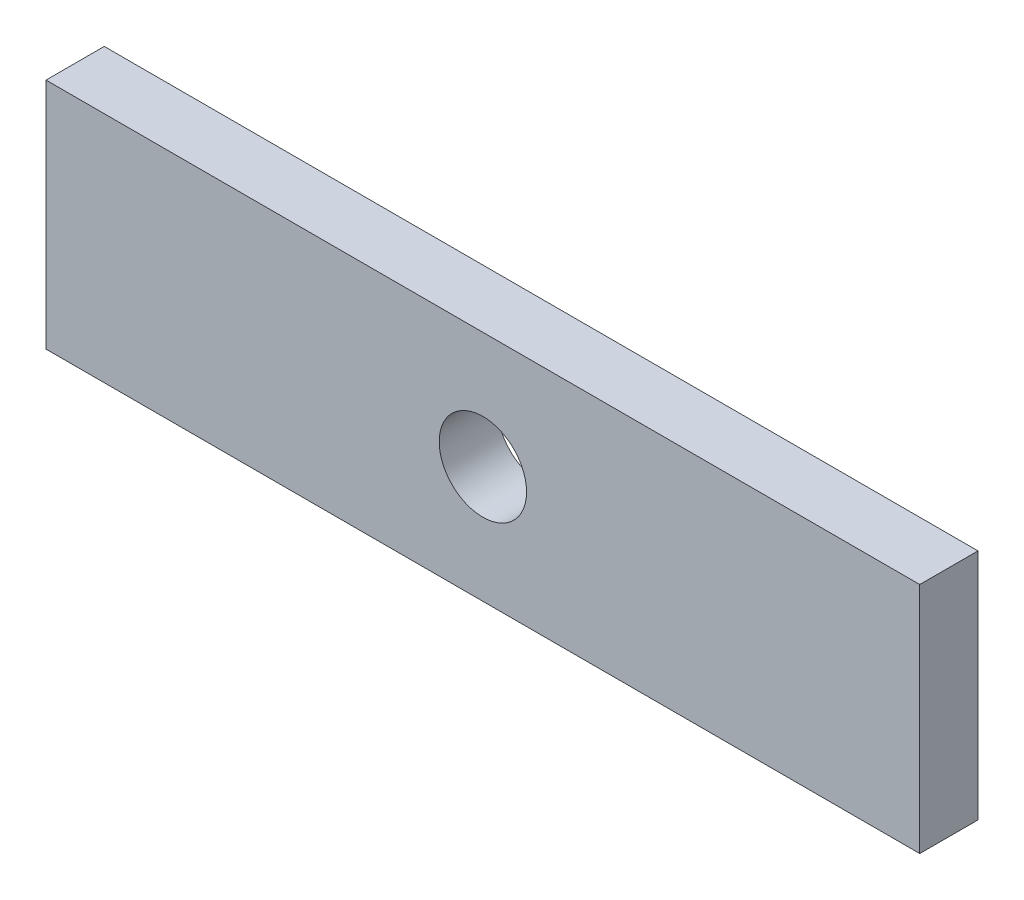
ISO-10303-21;
HEADER;
FILE_DESCRIPTION(('STEP AP214'),'2;1');
FILE_NAME('part.step','',(''),(''),'','','');
FILE_SCHEMA(('AUTOMOTIVE_DESIGN { 1 0 10303 214 1 1 1 1 }'));
ENDSEC;
DATA;
#1=APPLICATION_CONTEXT('core data for automotive mechanical design processes');
#2=APPLICATION_PROTOCOL_DEFINITION('international standard','automotive_design',2000,#1);
#3=PRODUCT_CONTEXT('',#1,'mechanical');
#4=PRODUCT('Part','Part','',(#3));
#5=PRODUCT_RELATED_PRODUCT_CATEGORY('part','',(#4));
#6=PRODUCT_DEFINITION_FORMATION('','',#4);
#7=PRODUCT_DEFINITION_CONTEXT('part definition',#1,'design');
#8=PRODUCT_DEFINITION('design','',#6,#7);
#9=PRODUCT_DEFINITION_SHAPE('','',#8);
#10=(LENGTH_UNIT() NAMED_UNIT(*) SI_UNIT(.MILLI.,.METRE.));
#11=(NAMED_UNIT(*) PLANE_ANGLE_UNIT() SI_UNIT($,.RADIAN.));
#12=(NAMED_UNIT(*) SI_UNIT($,.STERADIAN.) SOLID_ANGLE_UNIT());
#13=UNCERTAINTY_MEASURE_WITH_UNIT(LENGTH_MEASURE(1.E-05),#10,'distance_accuracy_value','');
#14=(GEOMETRIC_REPRESENTATION_CONTEXT(3) GLOBAL_UNCERTAINTY_ASSIGNED_CONTEXT((#13)) GLOBAL_UNIT_ASSIGNED_CONTEXT((#10,
#11,#12)) REPRESENTATION_CONTEXT('',''));
#15=CARTESIAN_POINT('',(0.,0.,0.));
#16=DIRECTION('',(0.,0.,1.));
#17=DIRECTION('',(1.,0.,0.));
#18=AXIS2_PLACEMENT_3D('',#15,#16,#17);
#19=CARTESIAN_POINT('',(0.,0.,10.));
#20=DIRECTION('',(0.,0.,-1.));
#21=DIRECTION('',(-1.,0.,0.));
#22=AXIS2_PLACEMENT_3D('',#19,#20,#21);
#23=PLANE('',#22);
#24=DIRECTION('',(0.,-1.,0.));
#25=VECTOR('',#24,1.);
#26=CARTESIAN_POINT('',(0.,0.,10.));
#27=LINE('',#26,#25);
#28=CARTESIAN_POINT('',(0.,40.,10.));
#29=VERTEX_POINT('',#28);
#30=CARTESIAN_POINT('',(0.,0.,10.));
#31=VERTEX_POINT('',#30);
#32=EDGE_CURVE('E85',#29,#31,#27,.T.);
#33=ORIENTED_EDGE('',*,*,#32,.T.);
#34=DIRECTION('',(1.,0.,0.));
#35=VECTOR('',#34,1.);
#36=CARTESIAN_POINT('',(0.,0.,10.));
#37=LINE('',#36,#35);
#38=CARTESIAN_POINT('',(150.,0.,10.));
#39=VERTEX_POINT('',#38);
#40=EDGE_CURVE('E80',#31,#39,#37,.T.);
#41=ORIENTED_EDGE('',*,*,#40,.T.);
#42=DIRECTION('',(0.,1.,0.));
#43=VECTOR('',#42,1.);
#44=CARTESIAN_POINT('',(150.,0.,10.));
#45=LINE('',#44,#43);
#46=CARTESIAN_POINT('',(150.,40.,10.));
#47=VERTEX_POINT('',#46);
#48=EDGE_CURVE('E83',#39,#47,#45,.T.);
#49=ORIENTED_EDGE('',*,*,#48,.T.);
#50=DIRECTION('',(-1.,0.,0.));
#51=VECTOR('',#50,1.);
#52=CARTESIAN_POINT('',(0.,40.,10.));
#53=LINE('',#52,#51);
#54=EDGE_CURVE('E50',#47,#29,#53,.T.);
#55=ORIENTED_EDGE('',*,*,#54,.T.);
#56=EDGE_LOOP('',(#33,#41,#49,#55));
#57=FACE_BOUND('',#56,.T.);
#58=CARTESIAN_POINT('',(75.,20.,10.));
#59=DIRECTION('',(0.,0.,1.));
#60=DIRECTION('',(1.,0.,0.));
#61=AXIS2_PLACEMENT_3D('',#58,#59,#60);
#62=CIRCLE('',#61,7.5);
#63=CARTESIAN_POINT('',(82.5,20.,10.));
#64=VERTEX_POINT('',#63);
#65=EDGE_CURVE('E100',#64,#64,#62,.T.);
#66=ORIENTED_EDGE('',*,*,#65,.F.);
#67=EDGE_LOOP('',(#66));
#68=FACE_BOUND('',#67,.T.);
#69=ADVANCED_FACE('F33',(#57,#68),#23,.F.);
#70=CARTESIAN_POINT('',(0.,0.,0.));
#71=DIRECTION('',(0.,0.,-1.));
#72=DIRECTION('',(-1.,0.,0.));
#73=AXIS2_PLACEMENT_3D('',#70,#71,#72);
#74=PLANE('',#73);
#75=DIRECTION('',(0.,-1.,0.));
#76=VECTOR('',#75,1.);
#77=CARTESIAN_POINT('',(0.,0.,0.));
#78=LINE('',#77,#76);
#79=CARTESIAN_POINT('',(0.,40.,0.));
#80=VERTEX_POINT('',#79);
#81=CARTESIAN_POINT('',(0.,0.,0.));
#82=VERTEX_POINT('',#81);
#83=EDGE_CURVE('E97',#80,#82,#78,.T.);
#84=ORIENTED_EDGE('',*,*,#83,.F.);
#85=DIRECTION('',(-1.,0.,0.));
#86=VECTOR('',#85,1.);
#87=CARTESIAN_POINT('',(0.,40.,0.));
#88=LINE('',#87,#86);
#89=CARTESIAN_POINT('',(150.,40.,0.));
#90=VERTEX_POINT('',#89);
#91=EDGE_CURVE('E73',#90,#80,#88,.T.);
#92=ORIENTED_EDGE('',*,*,#91,.F.);
#93=DIRECTION('',(0.,1.,0.));
#94=VECTOR('',#93,1.);
#95=CARTESIAN_POINT('',(150.,0.,0.));
#96=LINE('',#95,#94);
#97=CARTESIAN_POINT('',(150.,0.,0.));
#98=VERTEX_POINT('',#97);
#99=EDGE_CURVE('E67',#98,#90,#96,.T.);
#100=ORIENTED_EDGE('',*,*,#99,.F.);
#101=DIRECTION('',(1.,0.,0.));
#102=VECTOR('',#101,1.);
#103=CARTESIAN_POINT('',(0.,0.,0.));
#104=LINE('',#103,#102);
#105=EDGE_CURVE('E89',#82,#98,#104,.T.);
#106=ORIENTED_EDGE('',*,*,#105,.F.);
#107=EDGE_LOOP('',(#84,#92,#100,#106));
#108=FACE_BOUND('',#107,.T.);
#109=CARTESIAN_POINT('',(75.,20.,0.));
#110=DIRECTION('',(0.,0.,1.));
#111=DIRECTION('',(1.,0.,0.));
#112=AXIS2_PLACEMENT_3D('',#109,#110,#111);
#113=CIRCLE('',#112,7.5);
#114=CARTESIAN_POINT('',(82.5,20.,0.));
#115=VERTEX_POINT('',#114);
#116=EDGE_CURVE('E112',#115,#115,#113,.T.);
#117=ORIENTED_EDGE('',*,*,#116,.T.);
#118=EDGE_LOOP('',(#117));
#119=FACE_BOUND('',#118,.T.);
#120=ADVANCED_FACE('F108',(#108,#119),#74,.T.);
#121=CARTESIAN_POINT('',(0.,0.,10.));
#122=DIRECTION('',(1.,0.,0.));
#123=DIRECTION('',(0.,0.,-1.));
#124=AXIS2_PLACEMENT_3D('',#121,#122,#123);
#125=PLANE('',#124);
#126=ORIENTED_EDGE('',*,*,#83,.T.);
#127=DIRECTION('',(0.,0.,-1.));
#128=VECTOR('',#127,1.);
#129=CARTESIAN_POINT('',(0.,0.,10.));
#130=LINE('',#129,#128);
#131=EDGE_CURVE('E11',#31,#82,#130,.T.);
#132=ORIENTED_EDGE('',*,*,#131,.F.);
#133=ORIENTED_EDGE('',*,*,#32,.F.);
#134=DIRECTION('',(0.,0.,-1.));
#135=VECTOR('',#134,1.);
#136=CARTESIAN_POINT('',(0.,40.,10.));
#137=LINE('',#136,#135);
#138=EDGE_CURVE('E93',#29,#80,#137,.T.);
#139=ORIENTED_EDGE('',*,*,#138,.T.);
#140=EDGE_LOOP('',(#126,#132,#133,#139));
#141=FACE_BOUND('',#140,.T.);
#142=ADVANCED_FACE('F35',(#141),#125,.F.);
#143=CARTESIAN_POINT('',(0.,0.,10.));
#144=DIRECTION('',(0.,1.,0.));
#145=DIRECTION('',(0.,0.,1.));
#146=AXIS2_PLACEMENT_3D('',#143,#144,#145);
#147=PLANE('',#146);
#148=ORIENTED_EDGE('',*,*,#105,.T.);
#149=DIRECTION('',(0.,0.,-1.));
#150=VECTOR('',#149,1.);
#151=CARTESIAN_POINT('',(150.,0.,10.));
#152=LINE('',#151,#150);
#153=EDGE_CURVE('E42',#39,#98,#152,.T.);
#154=ORIENTED_EDGE('',*,*,#153,.F.);
#155=ORIENTED_EDGE('',*,*,#40,.F.);
#156=ORIENTED_EDGE('',*,*,#131,.T.);
#157=EDGE_LOOP('',(#148,#154,#155,#156));
#158=FACE_BOUND('',#157,.T.);
#159=ADVANCED_FACE('F88',(#158),#147,.F.);
#160=CARTESIAN_POINT('',(150.,0.,10.));
#161=DIRECTION('',(-1.,0.,0.));
#162=DIRECTION('',(0.,0.,1.));
#163=AXIS2_PLACEMENT_3D('',#160,#161,#162);
#164=PLANE('',#163);
#165=ORIENTED_EDGE('',*,*,#99,.T.);
#166=DIRECTION('',(0.,0.,-1.));
#167=VECTOR('',#166,1.);
#168=CARTESIAN_POINT('',(150.,40.,10.));
#169=LINE('',#168,#167);
#170=EDGE_CURVE('E90',#47,#90,#169,.T.);
#171=ORIENTED_EDGE('',*,*,#170,.F.);
#172=ORIENTED_EDGE('',*,*,#48,.F.);
#173=ORIENTED_EDGE('',*,*,#153,.T.);
#174=EDGE_LOOP('',(#165,#171,#172,#173));
#175=FACE_BOUND('',#174,.T.);
#176=ADVANCED_FACE('F91',(#175),#164,.F.);
#177=CARTESIAN_POINT('',(0.,40.,10.));
#178=DIRECTION('',(0.,-1.,0.));
#179=DIRECTION('',(0.,0.,-1.));
#180=AXIS2_PLACEMENT_3D('',#177,#178,#179);
#181=PLANE('',#180);
#182=ORIENTED_EDGE('',*,*,#91,.T.);
#183=ORIENTED_EDGE('',*,*,#138,.F.);
#184=ORIENTED_EDGE('',*,*,#54,.F.);
#185=ORIENTED_EDGE('',*,*,#170,.T.);
#186=EDGE_LOOP('',(#182,#183,#184,#185));
#187=FACE_BOUND('',#186,.T.);
#188=ADVANCED_FACE('F105',(#187),#181,.F.);
#189=CARTESIAN_POINT('',(75.,20.,10.));
#190=DIRECTION('',(0.,0.,-1.));
#191=DIRECTION('',(-1.,0.,0.));
#192=AXIS2_PLACEMENT_3D('',#189,#190,#191);
#193=CYLINDRICAL_SURFACE('',#192,7.5);
#194=ORIENTED_EDGE('',*,*,#65,.T.);
#195=EDGE_LOOP('',(#194));
#196=FACE_BOUND('',#195,.T.);
#197=ORIENTED_EDGE('',*,*,#116,.F.);
#198=EDGE_LOOP('',(#197));
#199=FACE_BOUND('',#198,.T.);
#200=ADVANCED_FACE('F118',(#196,#199),#193,.F.);
#201=CLOSED_SHELL('',(#69,#120,#142,#159,#176,#188,#200));
#202=MANIFOLD_SOLID_BREP('B2',#201);
#203=ADVANCED_BREP_SHAPE_REPRESENTATION('',(#18,#202),#14);
#204=SHAPE_DEFINITION_REPRESENTATION(#9,#203);
ENDSEC;
END-ISO-10303-21;
